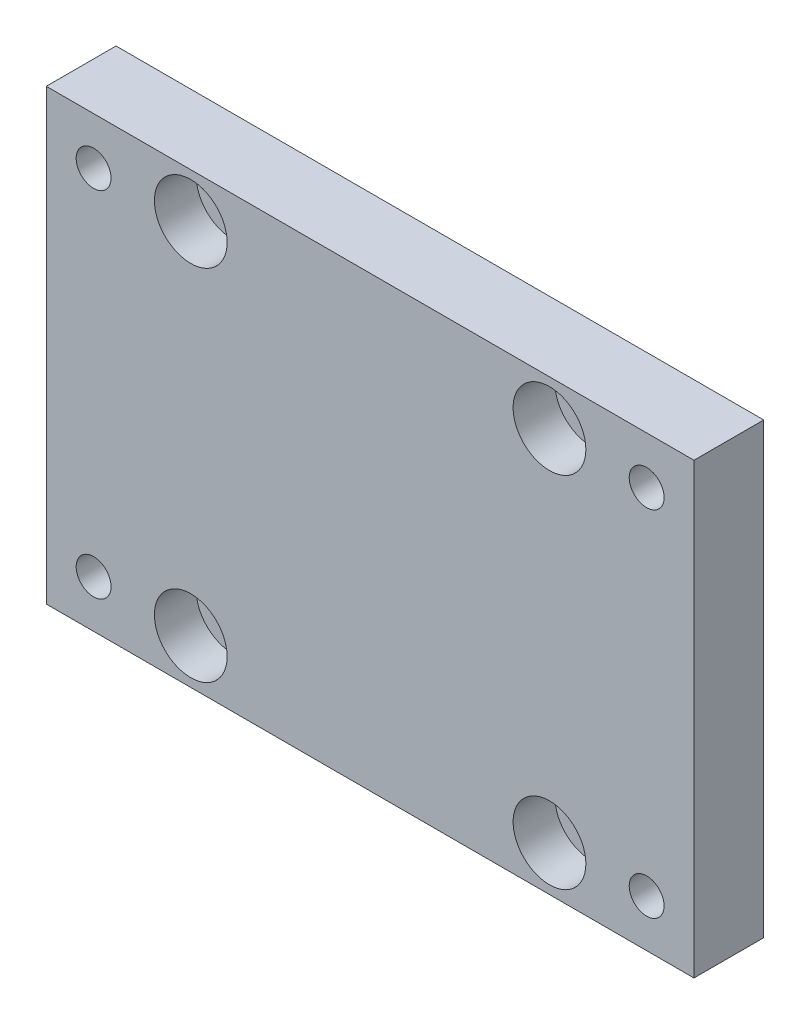
ISO-10303-21;
HEADER;
FILE_DESCRIPTION(('STEP AP214'),'2;1');
FILE_NAME('part.step','',(''),(''),'','','');
FILE_SCHEMA(('AUTOMOTIVE_DESIGN { 1 0 10303 214 1 1 1 1 }'));
ENDSEC;
DATA;
#1=APPLICATION_CONTEXT('core data for automotive mechanical design processes');
#2=APPLICATION_PROTOCOL_DEFINITION('international standard','automotive_design',2000,#1);
#3=PRODUCT_CONTEXT('',#1,'mechanical');
#4=PRODUCT('Part','Part','',(#3));
#5=PRODUCT_RELATED_PRODUCT_CATEGORY('part','',(#4));
#6=PRODUCT_DEFINITION_FORMATION('','',#4);
#7=PRODUCT_DEFINITION_CONTEXT('part definition',#1,'design');
#8=PRODUCT_DEFINITION('design','',#6,#7);
#9=PRODUCT_DEFINITION_SHAPE('','',#8);
#10=(LENGTH_UNIT() NAMED_UNIT(*) SI_UNIT(.MILLI.,.METRE.));
#11=(NAMED_UNIT(*) PLANE_ANGLE_UNIT() SI_UNIT($,.RADIAN.));
#12=(NAMED_UNIT(*) SI_UNIT($,.STERADIAN.) SOLID_ANGLE_UNIT());
#13=UNCERTAINTY_MEASURE_WITH_UNIT(LENGTH_MEASURE(1.E-05),#10,'distance_accuracy_value','');
#14=(GEOMETRIC_REPRESENTATION_CONTEXT(3) GLOBAL_UNCERTAINTY_ASSIGNED_CONTEXT((#13)) GLOBAL_UNIT_ASSIGNED_CONTEXT((#10,
#11,#12)) REPRESENTATION_CONTEXT('',''));
#15=CARTESIAN_POINT('',(0.,0.,0.));
#16=DIRECTION('',(0.,0.,1.));
#17=DIRECTION('',(1.,0.,0.));
#18=AXIS2_PLACEMENT_3D('',#15,#16,#17);
#19=CARTESIAN_POINT('',(-27.75,17.75,7.));
#20=DIRECTION('',(0.,0.,-1.));
#21=DIRECTION('',(-1.,0.,0.));
#22=AXIS2_PLACEMENT_3D('',#19,#20,#21);
#23=CYLINDRICAL_SURFACE('',#22,1.75);
#24=CARTESIAN_POINT('',(-27.75,17.75,7.));
#25=DIRECTION('',(0.,0.,1.));
#26=DIRECTION('',(1.,0.,0.));
#27=AXIS2_PLACEMENT_3D('',#24,#25,#26);
#28=CIRCLE('',#27,1.75);
#29=CARTESIAN_POINT('',(-26.,17.75,7.));
#30=VERTEX_POINT('',#29);
#31=EDGE_CURVE('E185',#30,#30,#28,.T.);
#32=ORIENTED_EDGE('',*,*,#31,.T.);
#33=EDGE_LOOP('',(#32));
#34=FACE_BOUND('',#33,.T.);
#35=CARTESIAN_POINT('',(-27.75,17.75,3.1));
#36=DIRECTION('',(0.,0.,-1.));
#37=DIRECTION('',(-1.,0.,0.));
#38=AXIS2_PLACEMENT_3D('',#35,#36,#37);
#39=CIRCLE('',#38,1.75);
#40=CARTESIAN_POINT('',(-29.5,17.75,3.1));
#41=VERTEX_POINT('',#40);
#42=EDGE_CURVE('E39',#41,#41,#39,.T.);
#43=ORIENTED_EDGE('',*,*,#42,.T.);
#44=EDGE_LOOP('',(#43));
#45=FACE_BOUND('',#44,.T.);
#46=ADVANCED_FACE('F35',(#34,#45),#23,.F.);
#47=CARTESIAN_POINT('',(27.75,17.75,7.));
#48=DIRECTION('',(0.,0.,-1.));
#49=DIRECTION('',(-1.,0.,0.));
#50=AXIS2_PLACEMENT_3D('',#47,#48,#49);
#51=CYLINDRICAL_SURFACE('',#50,1.75);
#52=CARTESIAN_POINT('',(27.75,17.75,7.));
#53=DIRECTION('',(0.,0.,1.));
#54=DIRECTION('',(-1.,0.,0.));
#55=AXIS2_PLACEMENT_3D('',#52,#53,#54);
#56=CIRCLE('',#55,1.75);
#57=CARTESIAN_POINT('',(26.,17.75,7.));
#58=VERTEX_POINT('',#57);
#59=EDGE_CURVE('E173',#58,#58,#56,.T.);
#60=ORIENTED_EDGE('',*,*,#59,.T.);
#61=EDGE_LOOP('',(#60));
#62=FACE_BOUND('',#61,.T.);
#63=CARTESIAN_POINT('',(27.75,17.75,3.1));
#64=DIRECTION('',(0.,0.,-1.));
#65=DIRECTION('',(-1.,0.,0.));
#66=AXIS2_PLACEMENT_3D('',#63,#64,#65);
#67=CIRCLE('',#66,1.75);
#68=CARTESIAN_POINT('',(26.,17.75,3.1));
#69=VERTEX_POINT('',#68);
#70=EDGE_CURVE('E118',#69,#69,#67,.T.);
#71=ORIENTED_EDGE('',*,*,#70,.T.);
#72=EDGE_LOOP('',(#71));
#73=FACE_BOUND('',#72,.T.);
#74=ADVANCED_FACE('F221',(#62,#73),#51,.F.);
#75=CARTESIAN_POINT('',(27.75,-17.75,7.));
#76=DIRECTION('',(0.,0.,-1.));
#77=DIRECTION('',(-1.,0.,0.));
#78=AXIS2_PLACEMENT_3D('',#75,#76,#77);
#79=CYLINDRICAL_SURFACE('',#78,1.75);
#80=CARTESIAN_POINT('',(27.75,-17.75,7.));
#81=DIRECTION('',(0.,0.,1.));
#82=DIRECTION('',(1.,0.,0.));
#83=AXIS2_PLACEMENT_3D('',#80,#81,#82);
#84=CIRCLE('',#83,1.75);
#85=CARTESIAN_POINT('',(29.5,-17.75,7.));
#86=VERTEX_POINT('',#85);
#87=EDGE_CURVE('E170',#86,#86,#84,.T.);
#88=ORIENTED_EDGE('',*,*,#87,.T.);
#89=EDGE_LOOP('',(#88));
#90=FACE_BOUND('',#89,.T.);
#91=CARTESIAN_POINT('',(27.75,-17.75,3.1));
#92=DIRECTION('',(0.,0.,-1.));
#93=DIRECTION('',(-1.,0.,0.));
#94=AXIS2_PLACEMENT_3D('',#91,#92,#93);
#95=CIRCLE('',#94,1.75);
#96=CARTESIAN_POINT('',(26.,-17.75,3.1));
#97=VERTEX_POINT('',#96);
#98=EDGE_CURVE('E115',#97,#97,#95,.T.);
#99=ORIENTED_EDGE('',*,*,#98,.T.);
#100=EDGE_LOOP('',(#99));
#101=FACE_BOUND('',#100,.T.);
#102=ADVANCED_FACE('F227',(#90,#101),#79,.F.);
#103=CARTESIAN_POINT('',(-27.75,-17.75,7.));
#104=DIRECTION('',(0.,0.,-1.));
#105=DIRECTION('',(-1.,0.,0.));
#106=AXIS2_PLACEMENT_3D('',#103,#104,#105);
#107=CYLINDRICAL_SURFACE('',#106,1.75);
#108=CARTESIAN_POINT('',(-27.75,-17.75,7.));
#109=DIRECTION('',(0.,0.,1.));
#110=DIRECTION('',(-1.,0.,0.));
#111=AXIS2_PLACEMENT_3D('',#108,#109,#110);
#112=CIRCLE('',#111,1.75);
#113=CARTESIAN_POINT('',(-29.5,-17.75,7.));
#114=VERTEX_POINT('',#113);
#115=EDGE_CURVE('E167',#114,#114,#112,.T.);
#116=ORIENTED_EDGE('',*,*,#115,.T.);
#117=EDGE_LOOP('',(#116));
#118=FACE_BOUND('',#117,.T.);
#119=CARTESIAN_POINT('',(-27.75,-17.75,3.1));
#120=DIRECTION('',(0.,0.,-1.));
#121=DIRECTION('',(-1.,0.,0.));
#122=AXIS2_PLACEMENT_3D('',#119,#120,#121);
#123=CIRCLE('',#122,1.75);
#124=CARTESIAN_POINT('',(-29.5,-17.75,3.1));
#125=VERTEX_POINT('',#124);
#126=EDGE_CURVE('E112',#125,#125,#123,.T.);
#127=ORIENTED_EDGE('',*,*,#126,.T.);
#128=EDGE_LOOP('',(#127));
#129=FACE_BOUND('',#128,.T.);
#130=ADVANCED_FACE('F198',(#118,#129),#107,.F.);
#131=CARTESIAN_POINT('',(-18.,18.,7.));
#132=DIRECTION('',(0.,0.,-1.));
#133=DIRECTION('',(-1.,0.,0.));
#134=AXIS2_PLACEMENT_3D('',#131,#132,#133);
#135=CYLINDRICAL_SURFACE('',#134,2.25);
#136=CARTESIAN_POINT('',(-18.,18.,0.));
#137=DIRECTION('',(0.,0.,1.));
#138=DIRECTION('',(1.,0.,0.));
#139=AXIS2_PLACEMENT_3D('',#136,#137,#138);
#140=CIRCLE('',#139,2.25);
#141=CARTESIAN_POINT('',(-15.75,18.,0.));
#142=VERTEX_POINT('',#141);
#143=EDGE_CURVE('E106',#142,#142,#140,.T.);
#144=ORIENTED_EDGE('',*,*,#143,.F.);
#145=EDGE_LOOP('',(#144));
#146=FACE_BOUND('',#145,.T.);
#147=CARTESIAN_POINT('',(-18.,18.,2.8));
#148=DIRECTION('',(0.,0.,1.));
#149=DIRECTION('',(1.,0.,0.));
#150=AXIS2_PLACEMENT_3D('',#147,#148,#149);
#151=CIRCLE('',#150,2.25000000000001);
#152=CARTESIAN_POINT('',(-15.75,18.,2.8));
#153=VERTEX_POINT('',#152);
#154=EDGE_CURVE('E132',#153,#153,#151,.T.);
#155=ORIENTED_EDGE('',*,*,#154,.T.);
#156=EDGE_LOOP('',(#155));
#157=FACE_BOUND('',#156,.T.);
#158=ADVANCED_FACE('F194',(#146,#157),#135,.F.);
#159=CARTESIAN_POINT('',(18.,18.,7.));
#160=DIRECTION('',(0.,0.,-1.));
#161=DIRECTION('',(-1.,0.,0.));
#162=AXIS2_PLACEMENT_3D('',#159,#160,#161);
#163=CYLINDRICAL_SURFACE('',#162,2.25);
#164=CARTESIAN_POINT('',(18.,18.,0.));
#165=DIRECTION('',(0.,0.,1.));
#166=DIRECTION('',(-1.,0.,0.));
#167=AXIS2_PLACEMENT_3D('',#164,#165,#166);
#168=CIRCLE('',#167,2.25);
#169=CARTESIAN_POINT('',(15.75,18.,0.));
#170=VERTEX_POINT('',#169);
#171=EDGE_CURVE('E182',#170,#170,#168,.T.);
#172=ORIENTED_EDGE('',*,*,#171,.F.);
#173=EDGE_LOOP('',(#172));
#174=FACE_BOUND('',#173,.T.);
#175=CARTESIAN_POINT('',(18.,18.,2.8));
#176=DIRECTION('',(0.,0.,1.));
#177=DIRECTION('',(1.,0.,0.));
#178=AXIS2_PLACEMENT_3D('',#175,#176,#177);
#179=CIRCLE('',#178,2.25000000000001);
#180=CARTESIAN_POINT('',(20.25,18.,2.8));
#181=VERTEX_POINT('',#180);
#182=EDGE_CURVE('E146',#181,#181,#179,.T.);
#183=ORIENTED_EDGE('',*,*,#182,.T.);
#184=EDGE_LOOP('',(#183));
#185=FACE_BOUND('',#184,.T.);
#186=ADVANCED_FACE('F197',(#174,#185),#163,.F.);
#187=CARTESIAN_POINT('',(18.,-18.,7.));
#188=DIRECTION('',(0.,0.,-1.));
#189=DIRECTION('',(-1.,0.,0.));
#190=AXIS2_PLACEMENT_3D('',#187,#188,#189);
#191=CYLINDRICAL_SURFACE('',#190,2.25);
#192=CARTESIAN_POINT('',(18.,-18.,0.));
#193=DIRECTION('',(0.,0.,1.));
#194=DIRECTION('',(1.,0.,0.));
#195=AXIS2_PLACEMENT_3D('',#192,#193,#194);
#196=CIRCLE('',#195,2.25);
#197=CARTESIAN_POINT('',(20.25,-18.,0.));
#198=VERTEX_POINT('',#197);
#199=EDGE_CURVE('E179',#198,#198,#196,.T.);
#200=ORIENTED_EDGE('',*,*,#199,.F.);
#201=EDGE_LOOP('',(#200));
#202=FACE_BOUND('',#201,.T.);
#203=CARTESIAN_POINT('',(18.,-18.,2.8));
#204=DIRECTION('',(0.,0.,1.));
#205=DIRECTION('',(1.,0.,0.));
#206=AXIS2_PLACEMENT_3D('',#203,#204,#205);
#207=CIRCLE('',#206,2.25000000000001);
#208=CARTESIAN_POINT('',(20.25,-18.,2.8));
#209=VERTEX_POINT('',#208);
#210=EDGE_CURVE('E155',#209,#209,#207,.T.);
#211=ORIENTED_EDGE('',*,*,#210,.T.);
#212=EDGE_LOOP('',(#211));
#213=FACE_BOUND('',#212,.T.);
#214=ADVANCED_FACE('F271',(#202,#213),#191,.F.);
#215=CARTESIAN_POINT('',(-18.,-18.,7.));
#216=DIRECTION('',(0.,0.,-1.));
#217=DIRECTION('',(-1.,0.,0.));
#218=AXIS2_PLACEMENT_3D('',#215,#216,#217);
#219=CYLINDRICAL_SURFACE('',#218,2.25);
#220=CARTESIAN_POINT('',(-18.,-18.,0.));
#221=DIRECTION('',(0.,0.,1.));
#222=DIRECTION('',(-1.,0.,0.));
#223=AXIS2_PLACEMENT_3D('',#220,#221,#222);
#224=CIRCLE('',#223,2.25);
#225=CARTESIAN_POINT('',(-20.25,-18.,0.));
#226=VERTEX_POINT('',#225);
#227=EDGE_CURVE('E176',#226,#226,#224,.T.);
#228=ORIENTED_EDGE('',*,*,#227,.F.);
#229=EDGE_LOOP('',(#228));
#230=FACE_BOUND('',#229,.T.);
#231=CARTESIAN_POINT('',(-18.,-18.,2.8));
#232=DIRECTION('',(0.,0.,1.));
#233=DIRECTION('',(1.,0.,0.));
#234=AXIS2_PLACEMENT_3D('',#231,#232,#233);
#235=CIRCLE('',#234,2.25000000000001);
#236=CARTESIAN_POINT('',(-15.75,-18.,2.8));
#237=VERTEX_POINT('',#236);
#238=EDGE_CURVE('E164',#237,#237,#235,.T.);
#239=ORIENTED_EDGE('',*,*,#238,.T.);
#240=EDGE_LOOP('',(#239));
#241=FACE_BOUND('',#240,.T.);
#242=ADVANCED_FACE('F235',(#230,#241),#219,.F.);
#243=CARTESIAN_POINT('',(0.,0.,7.));
#244=DIRECTION('',(0.,0.,1.));
#245=DIRECTION('',(1.,0.,0.));
#246=AXIS2_PLACEMENT_3D('',#243,#244,#245);
#247=PLANE('',#246);
#248=CARTESIAN_POINT('',(-18.,18.,7.));
#249=DIRECTION('',(0.,0.,1.));
#250=DIRECTION('',(1.,0.,0.));
#251=AXIS2_PLACEMENT_3D('',#248,#249,#250);
#252=CIRCLE('',#251,3.65000000000001);
#253=CARTESIAN_POINT('',(-14.35,18.,7.));
#254=VERTEX_POINT('',#253);
#255=EDGE_CURVE('E123',#254,#254,#252,.T.);
#256=ORIENTED_EDGE('',*,*,#255,.F.);
#257=EDGE_LOOP('',(#256));
#258=FACE_BOUND('',#257,.T.);
#259=CARTESIAN_POINT('',(18.,18.,7.));
#260=DIRECTION('',(0.,0.,1.));
#261=DIRECTION('',(1.,0.,0.));
#262=AXIS2_PLACEMENT_3D('',#259,#260,#261);
#263=CIRCLE('',#262,3.65000000000001);
#264=CARTESIAN_POINT('',(21.65,18.,7.));
#265=VERTEX_POINT('',#264);
#266=EDGE_CURVE('E140',#265,#265,#263,.T.);
#267=ORIENTED_EDGE('',*,*,#266,.F.);
#268=EDGE_LOOP('',(#267));
#269=FACE_BOUND('',#268,.T.);
#270=CARTESIAN_POINT('',(18.,-18.,7.));
#271=DIRECTION('',(0.,0.,1.));
#272=DIRECTION('',(1.,0.,0.));
#273=AXIS2_PLACEMENT_3D('',#270,#271,#272);
#274=CIRCLE('',#273,3.65000000000001);
#275=CARTESIAN_POINT('',(21.65,-18.,7.));
#276=VERTEX_POINT('',#275);
#277=EDGE_CURVE('E149',#276,#276,#274,.T.);
#278=ORIENTED_EDGE('',*,*,#277,.F.);
#279=EDGE_LOOP('',(#278));
#280=FACE_BOUND('',#279,.T.);
#281=CARTESIAN_POINT('',(-18.,-18.,7.));
#282=DIRECTION('',(0.,0.,1.));
#283=DIRECTION('',(1.,0.,0.));
#284=AXIS2_PLACEMENT_3D('',#281,#282,#283);
#285=CIRCLE('',#284,3.65000000000001);
#286=CARTESIAN_POINT('',(-14.35,-18.,7.));
#287=VERTEX_POINT('',#286);
#288=EDGE_CURVE('E158',#287,#287,#285,.T.);
#289=ORIENTED_EDGE('',*,*,#288,.F.);
#290=EDGE_LOOP('',(#289));
#291=FACE_BOUND('',#290,.T.);
#292=ORIENTED_EDGE('',*,*,#87,.F.);
#293=EDGE_LOOP('',(#292));
#294=FACE_BOUND('',#293,.T.);
#295=DIRECTION('',(0.,1.,0.));
#296=VECTOR('',#295,1.);
#297=CARTESIAN_POINT('',(32.5,22.5,7.));
#298=LINE('',#297,#296);
#299=CARTESIAN_POINT('',(32.5,-22.5,7.));
#300=VERTEX_POINT('',#299);
#301=CARTESIAN_POINT('',(32.5,22.5,7.));
#302=VERTEX_POINT('',#301);
#303=EDGE_CURVE('E90',#300,#302,#298,.T.);
#304=ORIENTED_EDGE('',*,*,#303,.T.);
#305=DIRECTION('',(-1.,0.,0.));
#306=VECTOR('',#305,1.);
#307=CARTESIAN_POINT('',(-32.5,22.5,7.));
#308=LINE('',#307,#306);
#309=CARTESIAN_POINT('',(-32.5,22.5,7.));
#310=VERTEX_POINT('',#309);
#311=EDGE_CURVE('E84',#302,#310,#308,.T.);
#312=ORIENTED_EDGE('',*,*,#311,.T.);
#313=DIRECTION('',(0.,-1.,0.));
#314=VECTOR('',#313,1.);
#315=CARTESIAN_POINT('',(-32.5,22.5,7.));
#316=LINE('',#315,#314);
#317=CARTESIAN_POINT('',(-32.5,-22.5,7.));
#318=VERTEX_POINT('',#317);
#319=EDGE_CURVE('E88',#310,#318,#316,.T.);
#320=ORIENTED_EDGE('',*,*,#319,.T.);
#321=DIRECTION('',(1.,0.,0.));
#322=VECTOR('',#321,1.);
#323=CARTESIAN_POINT('',(-32.5,-22.5,7.));
#324=LINE('',#323,#322);
#325=EDGE_CURVE('E54',#318,#300,#324,.T.);
#326=ORIENTED_EDGE('',*,*,#325,.T.);
#327=EDGE_LOOP('',(#304,#312,#320,#326));
#328=FACE_BOUND('',#327,.T.);
#329=ORIENTED_EDGE('',*,*,#31,.F.);
#330=EDGE_LOOP('',(#329));
#331=FACE_BOUND('',#330,.T.);
#332=ORIENTED_EDGE('',*,*,#59,.F.);
#333=EDGE_LOOP('',(#332));
#334=FACE_BOUND('',#333,.T.);
#335=ORIENTED_EDGE('',*,*,#115,.F.);
#336=EDGE_LOOP('',(#335));
#337=FACE_BOUND('',#336,.T.);
#338=ADVANCED_FACE('F85',(#258,#269,#280,#291,#294,#328,#331,#334,#337),#247,.T.);
#339=CARTESIAN_POINT('',(0.,0.,0.));
#340=DIRECTION('',(0.,0.,1.));
#341=DIRECTION('',(1.,0.,0.));
#342=AXIS2_PLACEMENT_3D('',#339,#340,#341);
#343=PLANE('',#342);
#344=CARTESIAN_POINT('',(27.75,-17.75,0.));
#345=DIRECTION('',(0.,0.,-1.));
#346=DIRECTION('',(-1.,0.,0.));
#347=AXIS2_PLACEMENT_3D('',#344,#345,#346);
#348=CIRCLE('',#347,2.9);
#349=CARTESIAN_POINT('',(24.85,-17.75,0.));
#350=VERTEX_POINT('',#349);
#351=EDGE_CURVE('E434',#350,#350,#348,.T.);
#352=ORIENTED_EDGE('',*,*,#351,.F.);
#353=EDGE_LOOP('',(#352));
#354=FACE_BOUND('',#353,.T.);
#355=CARTESIAN_POINT('',(-27.75,-17.75,0.));
#356=DIRECTION('',(0.,0.,-1.));
#357=DIRECTION('',(-1.,0.,0.));
#358=AXIS2_PLACEMENT_3D('',#355,#356,#357);
#359=CIRCLE('',#358,2.9);
#360=CARTESIAN_POINT('',(-30.65,-17.75,0.));
#361=VERTEX_POINT('',#360);
#362=EDGE_CURVE('E433',#361,#361,#359,.T.);
#363=ORIENTED_EDGE('',*,*,#362,.F.);
#364=EDGE_LOOP('',(#363));
#365=FACE_BOUND('',#364,.T.);
#366=CARTESIAN_POINT('',(-27.75,17.75,0.));
#367=DIRECTION('',(0.,0.,-1.));
#368=DIRECTION('',(-1.,0.,0.));
#369=AXIS2_PLACEMENT_3D('',#366,#367,#368);
#370=CIRCLE('',#369,2.9);
#371=CARTESIAN_POINT('',(-30.65,17.75,0.));
#372=VERTEX_POINT('',#371);
#373=EDGE_CURVE('E450',#372,#372,#370,.T.);
#374=ORIENTED_EDGE('',*,*,#373,.F.);
#375=EDGE_LOOP('',(#374));
#376=FACE_BOUND('',#375,.T.);
#377=CARTESIAN_POINT('',(27.75,17.75,0.));
#378=DIRECTION('',(0.,0.,-1.));
#379=DIRECTION('',(-1.,0.,0.));
#380=AXIS2_PLACEMENT_3D('',#377,#378,#379);
#381=CIRCLE('',#380,2.9);
#382=CARTESIAN_POINT('',(24.85,17.75,0.));
#383=VERTEX_POINT('',#382);
#384=EDGE_CURVE('E135',#383,#383,#381,.T.);
#385=ORIENTED_EDGE('',*,*,#384,.F.);
#386=EDGE_LOOP('',(#385));
#387=FACE_BOUND('',#386,.T.);
#388=DIRECTION('',(0.,1.,0.));
#389=VECTOR('',#388,1.);
#390=CARTESIAN_POINT('',(32.5,22.5,0.));
#391=LINE('',#390,#389);
#392=CARTESIAN_POINT('',(32.5,-22.5,0.));
#393=VERTEX_POINT('',#392);
#394=CARTESIAN_POINT('',(32.5,22.5,0.));
#395=VERTEX_POINT('',#394);
#396=EDGE_CURVE('E103',#393,#395,#391,.T.);
#397=ORIENTED_EDGE('',*,*,#396,.F.);
#398=DIRECTION('',(1.,0.,0.));
#399=VECTOR('',#398,1.);
#400=CARTESIAN_POINT('',(-32.5,-22.5,0.));
#401=LINE('',#400,#399);
#402=CARTESIAN_POINT('',(-32.5,-22.5,0.));
#403=VERTEX_POINT('',#402);
#404=EDGE_CURVE('E77',#403,#393,#401,.T.);
#405=ORIENTED_EDGE('',*,*,#404,.F.);
#406=DIRECTION('',(0.,-1.,0.));
#407=VECTOR('',#406,1.);
#408=CARTESIAN_POINT('',(-32.5,22.5,0.));
#409=LINE('',#408,#407);
#410=CARTESIAN_POINT('',(-32.5,22.5,0.));
#411=VERTEX_POINT('',#410);
#412=EDGE_CURVE('E71',#411,#403,#409,.T.);
#413=ORIENTED_EDGE('',*,*,#412,.F.);
#414=DIRECTION('',(-1.,0.,0.));
#415=VECTOR('',#414,1.);
#416=CARTESIAN_POINT('',(-32.5,22.5,0.));
#417=LINE('',#416,#415);
#418=EDGE_CURVE('E94',#395,#411,#417,.T.);
#419=ORIENTED_EDGE('',*,*,#418,.F.);
#420=EDGE_LOOP('',(#397,#405,#413,#419));
#421=FACE_BOUND('',#420,.T.);
#422=ORIENTED_EDGE('',*,*,#143,.T.);
#423=EDGE_LOOP('',(#422));
#424=FACE_BOUND('',#423,.T.);
#425=ORIENTED_EDGE('',*,*,#171,.T.);
#426=EDGE_LOOP('',(#425));
#427=FACE_BOUND('',#426,.T.);
#428=ORIENTED_EDGE('',*,*,#199,.T.);
#429=EDGE_LOOP('',(#428));
#430=FACE_BOUND('',#429,.T.);
#431=ORIENTED_EDGE('',*,*,#227,.T.);
#432=EDGE_LOOP('',(#431));
#433=FACE_BOUND('',#432,.T.);
#434=ADVANCED_FACE('F191',(#354,#365,#376,#387,#421,#424,#427,#430,#433),#343,.F.);
#435=CARTESIAN_POINT('',(32.5,22.5,7.));
#436=DIRECTION('',(-1.,0.,0.));
#437=DIRECTION('',(0.,0.,1.));
#438=AXIS2_PLACEMENT_3D('',#435,#436,#437);
#439=PLANE('',#438);
#440=ORIENTED_EDGE('',*,*,#396,.T.);
#441=DIRECTION('',(0.,0.,-1.));
#442=VECTOR('',#441,1.);
#443=CARTESIAN_POINT('',(32.5,22.5,7.));
#444=LINE('',#443,#442);
#445=EDGE_CURVE('E11',#302,#395,#444,.T.);
#446=ORIENTED_EDGE('',*,*,#445,.F.);
#447=ORIENTED_EDGE('',*,*,#303,.F.);
#448=DIRECTION('',(0.,0.,-1.));
#449=VECTOR('',#448,1.);
#450=CARTESIAN_POINT('',(32.5,-22.5,7.));
#451=LINE('',#450,#449);
#452=EDGE_CURVE('E99',#300,#393,#451,.T.);
#453=ORIENTED_EDGE('',*,*,#452,.T.);
#454=EDGE_LOOP('',(#440,#446,#447,#453));
#455=FACE_BOUND('',#454,.T.);
#456=ADVANCED_FACE('F37',(#455),#439,.F.);
#457=CARTESIAN_POINT('',(-32.5,22.5,7.));
#458=DIRECTION('',(0.,-1.,0.));
#459=DIRECTION('',(0.,0.,-1.));
#460=AXIS2_PLACEMENT_3D('',#457,#458,#459);
#461=PLANE('',#460);
#462=ORIENTED_EDGE('',*,*,#418,.T.);
#463=DIRECTION('',(0.,0.,-1.));
#464=VECTOR('',#463,1.);
#465=CARTESIAN_POINT('',(-32.5,22.5,7.));
#466=LINE('',#465,#464);
#467=EDGE_CURVE('E45',#310,#411,#466,.T.);
#468=ORIENTED_EDGE('',*,*,#467,.F.);
#469=ORIENTED_EDGE('',*,*,#311,.F.);
#470=ORIENTED_EDGE('',*,*,#445,.T.);
#471=EDGE_LOOP('',(#462,#468,#469,#470));
#472=FACE_BOUND('',#471,.T.);
#473=ADVANCED_FACE('F93',(#472),#461,.F.);
#474=CARTESIAN_POINT('',(-32.5,22.5,7.));
#475=DIRECTION('',(1.,0.,0.));
#476=DIRECTION('',(0.,0.,-1.));
#477=AXIS2_PLACEMENT_3D('',#474,#475,#476);
#478=PLANE('',#477);
#479=ORIENTED_EDGE('',*,*,#412,.T.);
#480=DIRECTION('',(0.,0.,-1.));
#481=VECTOR('',#480,1.);
#482=CARTESIAN_POINT('',(-32.5,-22.5,7.));
#483=LINE('',#482,#481);
#484=EDGE_CURVE('E95',#318,#403,#483,.T.);
#485=ORIENTED_EDGE('',*,*,#484,.F.);
#486=ORIENTED_EDGE('',*,*,#319,.F.);
#487=ORIENTED_EDGE('',*,*,#467,.T.);
#488=EDGE_LOOP('',(#479,#485,#486,#487));
#489=FACE_BOUND('',#488,.T.);
#490=ADVANCED_FACE('F97',(#489),#478,.F.);
#491=CARTESIAN_POINT('',(-32.5,-22.5,7.));
#492=DIRECTION('',(0.,1.,0.));
#493=DIRECTION('',(0.,0.,1.));
#494=AXIS2_PLACEMENT_3D('',#491,#492,#493);
#495=PLANE('',#494);
#496=ORIENTED_EDGE('',*,*,#404,.T.);
#497=ORIENTED_EDGE('',*,*,#452,.F.);
#498=ORIENTED_EDGE('',*,*,#325,.F.);
#499=ORIENTED_EDGE('',*,*,#484,.T.);
#500=EDGE_LOOP('',(#496,#497,#498,#499));
#501=FACE_BOUND('',#500,.T.);
#502=ADVANCED_FACE('F240',(#501),#495,.F.);
#503=CARTESIAN_POINT('',(-15.75,-18.,2.8));
#504=DIRECTION('',(0.,0.,-1.));
#505=DIRECTION('',(-1.,0.,0.));
#506=AXIS2_PLACEMENT_3D('',#503,#504,#505);
#507=PLANE('',#506);
#508=ORIENTED_EDGE('',*,*,#238,.F.);
#509=EDGE_LOOP('',(#508));
#510=FACE_BOUND('',#509,.T.);
#511=CARTESIAN_POINT('',(-18.,-18.,2.8));
#512=DIRECTION('',(0.,0.,1.));
#513=DIRECTION('',(1.,0.,0.));
#514=AXIS2_PLACEMENT_3D('',#511,#512,#513);
#515=CIRCLE('',#514,3.65000000000001);
#516=CARTESIAN_POINT('',(-14.35,-18.,2.8));
#517=VERTEX_POINT('',#516);
#518=EDGE_CURVE('E161',#517,#517,#515,.T.);
#519=ORIENTED_EDGE('',*,*,#518,.T.);
#520=EDGE_LOOP('',(#519));
#521=FACE_BOUND('',#520,.T.);
#522=ADVANCED_FACE('F243',(#510,#521),#507,.F.);
#523=CARTESIAN_POINT('',(-18.,-18.,7.));
#524=DIRECTION('',(0.,0.,1.));
#525=DIRECTION('',(1.,0.,0.));
#526=AXIS2_PLACEMENT_3D('',#523,#524,#525);
#527=CYLINDRICAL_SURFACE('',#526,3.65000000000001);
#528=ORIENTED_EDGE('',*,*,#518,.F.);
#529=EDGE_LOOP('',(#528));
#530=FACE_BOUND('',#529,.T.);
#531=ORIENTED_EDGE('',*,*,#288,.T.);
#532=EDGE_LOOP('',(#531));
#533=FACE_BOUND('',#532,.T.);
#534=ADVANCED_FACE('F361',(#530,#533),#527,.F.);
#535=CARTESIAN_POINT('',(20.25,-18.,2.8));
#536=DIRECTION('',(0.,0.,-1.));
#537=DIRECTION('',(-1.,0.,0.));
#538=AXIS2_PLACEMENT_3D('',#535,#536,#537);
#539=PLANE('',#538);
#540=ORIENTED_EDGE('',*,*,#210,.F.);
#541=EDGE_LOOP('',(#540));
#542=FACE_BOUND('',#541,.T.);
#543=CARTESIAN_POINT('',(18.,-18.,2.8));
#544=DIRECTION('',(0.,0.,1.));
#545=DIRECTION('',(1.,0.,0.));
#546=AXIS2_PLACEMENT_3D('',#543,#544,#545);
#547=CIRCLE('',#546,3.65000000000001);
#548=CARTESIAN_POINT('',(21.65,-18.,2.8));
#549=VERTEX_POINT('',#548);
#550=EDGE_CURVE('E152',#549,#549,#547,.T.);
#551=ORIENTED_EDGE('',*,*,#550,.T.);
#552=EDGE_LOOP('',(#551));
#553=FACE_BOUND('',#552,.T.);
#554=ADVANCED_FACE('F351',(#542,#553),#539,.F.);
#555=CARTESIAN_POINT('',(18.,-18.,7.));
#556=DIRECTION('',(0.,0.,1.));
#557=DIRECTION('',(1.,0.,0.));
#558=AXIS2_PLACEMENT_3D('',#555,#556,#557);
#559=CYLINDRICAL_SURFACE('',#558,3.65000000000001);
#560=ORIENTED_EDGE('',*,*,#550,.F.);
#561=EDGE_LOOP('',(#560));
#562=FACE_BOUND('',#561,.T.);
#563=ORIENTED_EDGE('',*,*,#277,.T.);
#564=EDGE_LOOP('',(#563));
#565=FACE_BOUND('',#564,.T.);
#566=ADVANCED_FACE('F341',(#562,#565),#559,.F.);
#567=CARTESIAN_POINT('',(20.25,18.,2.8));
#568=DIRECTION('',(0.,0.,-1.));
#569=DIRECTION('',(-1.,0.,0.));
#570=AXIS2_PLACEMENT_3D('',#567,#568,#569);
#571=PLANE('',#570);
#572=ORIENTED_EDGE('',*,*,#182,.F.);
#573=EDGE_LOOP('',(#572));
#574=FACE_BOUND('',#573,.T.);
#575=CARTESIAN_POINT('',(18.,18.,2.8));
#576=DIRECTION('',(0.,0.,1.));
#577=DIRECTION('',(1.,0.,0.));
#578=AXIS2_PLACEMENT_3D('',#575,#576,#577);
#579=CIRCLE('',#578,3.65000000000001);
#580=CARTESIAN_POINT('',(21.65,18.,2.8));
#581=VERTEX_POINT('',#580);
#582=EDGE_CURVE('E143',#581,#581,#579,.T.);
#583=ORIENTED_EDGE('',*,*,#582,.T.);
#584=EDGE_LOOP('',(#583));
#585=FACE_BOUND('',#584,.T.);
#586=ADVANCED_FACE('F331',(#574,#585),#571,.F.);
#587=CARTESIAN_POINT('',(18.,18.,7.));
#588=DIRECTION('',(0.,0.,1.));
#589=DIRECTION('',(1.,0.,0.));
#590=AXIS2_PLACEMENT_3D('',#587,#588,#589);
#591=CYLINDRICAL_SURFACE('',#590,3.65000000000001);
#592=ORIENTED_EDGE('',*,*,#582,.F.);
#593=EDGE_LOOP('',(#592));
#594=FACE_BOUND('',#593,.T.);
#595=ORIENTED_EDGE('',*,*,#266,.T.);
#596=EDGE_LOOP('',(#595));
#597=FACE_BOUND('',#596,.T.);
#598=ADVANCED_FACE('F206',(#594,#597),#591,.F.);
#599=CARTESIAN_POINT('',(-15.75,18.,2.8));
#600=DIRECTION('',(0.,0.,-1.));
#601=DIRECTION('',(-1.,0.,0.));
#602=AXIS2_PLACEMENT_3D('',#599,#600,#601);
#603=PLANE('',#602);
#604=ORIENTED_EDGE('',*,*,#154,.F.);
#605=EDGE_LOOP('',(#604));
#606=FACE_BOUND('',#605,.T.);
#607=CARTESIAN_POINT('',(-18.,18.,2.8));
#608=DIRECTION('',(0.,0.,1.));
#609=DIRECTION('',(1.,0.,0.));
#610=AXIS2_PLACEMENT_3D('',#607,#608,#609);
#611=CIRCLE('',#610,3.65000000000001);
#612=CARTESIAN_POINT('',(-14.35,18.,2.8));
#613=VERTEX_POINT('',#612);
#614=EDGE_CURVE('E127',#613,#613,#611,.T.);
#615=ORIENTED_EDGE('',*,*,#614,.T.);
#616=EDGE_LOOP('',(#615));
#617=FACE_BOUND('',#616,.T.);
#618=ADVANCED_FACE('F202',(#606,#617),#603,.F.);
#619=CARTESIAN_POINT('',(-18.,18.,7.));
#620=DIRECTION('',(0.,0.,1.));
#621=DIRECTION('',(1.,0.,0.));
#622=AXIS2_PLACEMENT_3D('',#619,#620,#621);
#623=CYLINDRICAL_SURFACE('',#622,3.65000000000001);
#624=ORIENTED_EDGE('',*,*,#614,.F.);
#625=EDGE_LOOP('',(#624));
#626=FACE_BOUND('',#625,.T.);
#627=ORIENTED_EDGE('',*,*,#255,.T.);
#628=EDGE_LOOP('',(#627));
#629=FACE_BOUND('',#628,.T.);
#630=ADVANCED_FACE('F205',(#626,#629),#623,.F.);
#631=CARTESIAN_POINT('',(-27.75,-17.75,3.1));
#632=DIRECTION('',(0.,0.,-1.));
#633=DIRECTION('',(-1.,0.,0.));
#634=AXIS2_PLACEMENT_3D('',#631,#632,#633);
#635=CYLINDRICAL_SURFACE('',#634,2.9);
#636=CARTESIAN_POINT('',(-27.75,-17.75,3.1));
#637=DIRECTION('',(0.,0.,-1.));
#638=DIRECTION('',(-1.,0.,0.));
#639=AXIS2_PLACEMENT_3D('',#636,#637,#638);
#640=CIRCLE('',#639,2.9);
#641=CARTESIAN_POINT('',(-30.65,-17.75,3.1));
#642=VERTEX_POINT('',#641);
#643=EDGE_CURVE('E437',#642,#642,#640,.T.);
#644=CARTESIAN_POINT('',(-30.65,-17.75,3.1));
#645=CARTESIAN_POINT('',(-30.65,-17.75,3.06770833333333));
#646=CARTESIAN_POINT('',(-30.65,-17.75,3.03541666666667));
#647=CARTESIAN_POINT('',(-30.65,-17.75,2.97083333333333));
#648=CARTESIAN_POINT('',(-30.65,-17.75,2.93854166666667));
#649=CARTESIAN_POINT('',(-30.65,-17.75,2.87395833333333));
#650=CARTESIAN_POINT('',(-30.65,-17.75,2.84166666666667));
#651=CARTESIAN_POINT('',(-30.65,-17.75,2.77708333333333));
#652=CARTESIAN_POINT('',(-30.65,-17.75,2.74479166666667));
#653=CARTESIAN_POINT('',(-30.65,-17.75,2.68020833333333));
#654=CARTESIAN_POINT('',(-30.65,-17.75,2.64791666666667));
#655=CARTESIAN_POINT('',(-30.65,-17.75,2.58333333333333));
#656=CARTESIAN_POINT('',(-30.65,-17.75,2.55104166666667));
#657=CARTESIAN_POINT('',(-30.65,-17.75,2.48645833333333));
#658=CARTESIAN_POINT('',(-30.65,-17.75,2.45416666666667));
#659=CARTESIAN_POINT('',(-30.65,-17.75,2.38958333333333));
#660=CARTESIAN_POINT('',(-30.65,-17.75,2.35729166666667));
#661=CARTESIAN_POINT('',(-30.65,-17.75,2.29270833333333));
#662=CARTESIAN_POINT('',(-30.65,-17.75,2.26041666666667));
#663=CARTESIAN_POINT('',(-30.65,-17.75,2.19583333333333));
#664=CARTESIAN_POINT('',(-30.65,-17.75,2.16354166666667));
#665=CARTESIAN_POINT('',(-30.65,-17.75,2.09895833333333));
#666=CARTESIAN_POINT('',(-30.65,-17.75,2.06666666666667));
#667=CARTESIAN_POINT('',(-30.65,-17.75,2.00208333333333));
#668=CARTESIAN_POINT('',(-30.65,-17.75,1.96979166666667));
#669=CARTESIAN_POINT('',(-30.65,-17.75,1.90520833333333));
#670=CARTESIAN_POINT('',(-30.65,-17.75,1.87291666666667));
#671=CARTESIAN_POINT('',(-30.65,-17.75,1.80833333333333));
#672=CARTESIAN_POINT('',(-30.65,-17.75,1.77604166666667));
#673=CARTESIAN_POINT('',(-30.65,-17.75,1.71145833333333));
#674=CARTESIAN_POINT('',(-30.65,-17.75,1.67916666666667));
#675=CARTESIAN_POINT('',(-30.65,-17.75,1.61458333333333));
#676=CARTESIAN_POINT('',(-30.65,-17.75,1.58229166666667));
#677=CARTESIAN_POINT('',(-30.65,-17.75,1.51770833333333));
#678=CARTESIAN_POINT('',(-30.65,-17.75,1.48541666666667));
#679=CARTESIAN_POINT('',(-30.65,-17.75,1.42083333333333));
#680=CARTESIAN_POINT('',(-30.65,-17.75,1.38854166666667));
#681=CARTESIAN_POINT('',(-30.65,-17.75,1.32395833333333));
#682=CARTESIAN_POINT('',(-30.65,-17.75,1.29166666666667));
#683=CARTESIAN_POINT('',(-30.65,-17.75,1.22708333333333));
#684=CARTESIAN_POINT('',(-30.65,-17.75,1.19479166666667));
#685=CARTESIAN_POINT('',(-30.65,-17.75,1.13020833333333));
#686=CARTESIAN_POINT('',(-30.65,-17.75,1.09791666666667));
#687=CARTESIAN_POINT('',(-30.65,-17.75,1.03333333333333));
#688=CARTESIAN_POINT('',(-30.65,-17.75,1.00104166666667));
#689=CARTESIAN_POINT('',(-30.65,-17.75,0.936458333333334));
#690=CARTESIAN_POINT('',(-30.65,-17.75,0.904166666666667));
#691=CARTESIAN_POINT('',(-30.65,-17.75,0.839583333333334));
#692=CARTESIAN_POINT('',(-30.65,-17.75,0.807291666666667));
#693=CARTESIAN_POINT('',(-30.65,-17.75,0.742708333333334));
#694=CARTESIAN_POINT('',(-30.65,-17.75,0.710416666666667));
#695=CARTESIAN_POINT('',(-30.65,-17.75,0.645833333333334));
#696=CARTESIAN_POINT('',(-30.65,-17.75,0.613541666666667));
#697=CARTESIAN_POINT('',(-30.65,-17.75,0.548958333333333));
#698=CARTESIAN_POINT('',(-30.65,-17.75,0.516666666666667));
#699=CARTESIAN_POINT('',(-30.65,-17.75,0.452083333333333));
#700=CARTESIAN_POINT('',(-30.65,-17.75,0.419791666666667));
#701=CARTESIAN_POINT('',(-30.65,-17.75,0.355208333333334));
#702=CARTESIAN_POINT('',(-30.65,-17.75,0.322916666666667));
#703=CARTESIAN_POINT('',(-30.65,-17.75,0.258333333333333));
#704=CARTESIAN_POINT('',(-30.65,-17.75,0.226041666666667));
#705=CARTESIAN_POINT('',(-30.65,-17.75,0.161458333333333));
#706=CARTESIAN_POINT('',(-30.65,-17.75,0.129166666666667));
#707=CARTESIAN_POINT('',(-30.65,-17.75,0.0645833333333335));
#708=CARTESIAN_POINT('',(-30.65,-17.75,0.0322916666666667));
#709=CARTESIAN_POINT('',(-30.65,-17.75,0.));
#710=B_SPLINE_CURVE_WITH_KNOTS('',3,(#644,#645,#646,#647,#648,#649,#650,#651,#652,#653,#654,
#655,#656,#657,#658,#659,#660,#661,#662,#663,#664,#665,#666,#667,#668,#669,#670,#671,#672,#673,
#674,#675,#676,#677,#678,#679,#680,#681,#682,#683,#684,#685,#686,#687,#688,#689,#690,#691,#692,
#693,#694,#695,#696,#697,#698,#699,#700,#701,#702,#703,#704,#705,#706,#707,#708,#709),
.UNSPECIFIED.,.F.,.F.,(4,2,2,2,2,2,2,2,2,2,2,2,2,2,2,2,2,2,2,2,2,2,2,2,2,2,2,2,2,2,2,2,4),(0.,
0.0968750000000002,0.19375,0.290625,0.3875,0.484375,0.58125,0.678125,0.775,0.871875,0.96875,
1.065625,1.1625,1.259375,1.35625,1.453125,1.55,1.646875,1.74375,1.840625,1.9375,2.034375,
2.13125,2.228125,2.325,2.421875,2.51875,2.615625,2.7125,2.809375,2.90625,3.003125,3.1),.UNSPECIFIED.);
#711=EDGE_CURVE('BSEAM211',#642,#361,#710,.T.);
#712=ORIENTED_EDGE('',*,*,#643,.F.);
#713=ORIENTED_EDGE('',*,*,#362,.T.);
#714=ORIENTED_EDGE('',*,*,#711,.T.);
#715=ORIENTED_EDGE('',*,*,#711,.F.);
#716=EDGE_LOOP('',(#712,#714,#713,#715));
#717=FACE_BOUND('',#716,.T.);
#718=ADVANCED_FACE('F211',(#717),#635,.F.);
#719=CARTESIAN_POINT('',(-27.75,-17.75,3.1));
#720=DIRECTION('',(0.,0.,-1.));
#721=DIRECTION('',(-1.,0.,0.));
#722=AXIS2_PLACEMENT_3D('',#719,#720,#721);
#723=PLANE('',#722);
#724=ORIENTED_EDGE('',*,*,#126,.F.);
#725=EDGE_LOOP('',(#724));
#726=FACE_BOUND('',#725,.T.);
#727=ORIENTED_EDGE('',*,*,#643,.T.);
#728=EDGE_LOOP('',(#727));
#729=FACE_BOUND('',#728,.T.);
#730=ADVANCED_FACE('F216',(#726,#729),#723,.T.);
#731=CARTESIAN_POINT('',(27.75,-17.75,3.1));
#732=DIRECTION('',(0.,0.,-1.));
#733=DIRECTION('',(-1.,0.,0.));
#734=AXIS2_PLACEMENT_3D('',#731,#732,#733);
#735=CYLINDRICAL_SURFACE('',#734,2.9);
#736=CARTESIAN_POINT('',(27.75,-17.75,3.1));
#737=DIRECTION('',(0.,0.,-1.));
#738=DIRECTION('',(-1.,0.,0.));
#739=AXIS2_PLACEMENT_3D('',#736,#737,#738);
#740=CIRCLE('',#739,2.9);
#741=CARTESIAN_POINT('',(24.85,-17.75,3.1));
#742=VERTEX_POINT('',#741);
#743=EDGE_CURVE('E431',#742,#742,#740,.T.);
#744=CARTESIAN_POINT('',(24.85,-17.75,3.1));
#745=CARTESIAN_POINT('',(24.85,-17.75,3.06770833333333));
#746=CARTESIAN_POINT('',(24.85,-17.75,3.03541666666667));
#747=CARTESIAN_POINT('',(24.85,-17.75,2.97083333333333));
#748=CARTESIAN_POINT('',(24.85,-17.75,2.93854166666667));
#749=CARTESIAN_POINT('',(24.85,-17.75,2.87395833333333));
#750=CARTESIAN_POINT('',(24.85,-17.75,2.84166666666667));
#751=CARTESIAN_POINT('',(24.85,-17.75,2.77708333333333));
#752=CARTESIAN_POINT('',(24.85,-17.75,2.74479166666667));
#753=CARTESIAN_POINT('',(24.85,-17.75,2.68020833333333));
#754=CARTESIAN_POINT('',(24.85,-17.75,2.64791666666667));
#755=CARTESIAN_POINT('',(24.85,-17.75,2.58333333333333));
#756=CARTESIAN_POINT('',(24.85,-17.75,2.55104166666667));
#757=CARTESIAN_POINT('',(24.85,-17.75,2.48645833333333));
#758=CARTESIAN_POINT('',(24.85,-17.75,2.45416666666667));
#759=CARTESIAN_POINT('',(24.85,-17.75,2.38958333333333));
#760=CARTESIAN_POINT('',(24.85,-17.75,2.35729166666667));
#761=CARTESIAN_POINT('',(24.85,-17.75,2.29270833333333));
#762=CARTESIAN_POINT('',(24.85,-17.75,2.26041666666667));
#763=CARTESIAN_POINT('',(24.85,-17.75,2.19583333333333));
#764=CARTESIAN_POINT('',(24.85,-17.75,2.16354166666667));
#765=CARTESIAN_POINT('',(24.85,-17.75,2.09895833333333));
#766=CARTESIAN_POINT('',(24.85,-17.75,2.06666666666667));
#767=CARTESIAN_POINT('',(24.85,-17.75,2.00208333333333));
#768=CARTESIAN_POINT('',(24.85,-17.75,1.96979166666667));
#769=CARTESIAN_POINT('',(24.85,-17.75,1.90520833333333));
#770=CARTESIAN_POINT('',(24.85,-17.75,1.87291666666667));
#771=CARTESIAN_POINT('',(24.85,-17.75,1.80833333333333));
#772=CARTESIAN_POINT('',(24.85,-17.75,1.77604166666667));
#773=CARTESIAN_POINT('',(24.85,-17.75,1.71145833333333));
#774=CARTESIAN_POINT('',(24.85,-17.75,1.67916666666667));
#775=CARTESIAN_POINT('',(24.85,-17.75,1.61458333333333));
#776=CARTESIAN_POINT('',(24.85,-17.75,1.58229166666667));
#777=CARTESIAN_POINT('',(24.85,-17.75,1.51770833333333));
#778=CARTESIAN_POINT('',(24.85,-17.75,1.48541666666667));
#779=CARTESIAN_POINT('',(24.85,-17.75,1.42083333333333));
#780=CARTESIAN_POINT('',(24.85,-17.75,1.38854166666667));
#781=CARTESIAN_POINT('',(24.85,-17.75,1.32395833333333));
#782=CARTESIAN_POINT('',(24.85,-17.75,1.29166666666667));
#783=CARTESIAN_POINT('',(24.85,-17.75,1.22708333333333));
#784=CARTESIAN_POINT('',(24.85,-17.75,1.19479166666667));
#785=CARTESIAN_POINT('',(24.85,-17.75,1.13020833333333));
#786=CARTESIAN_POINT('',(24.85,-17.75,1.09791666666667));
#787=CARTESIAN_POINT('',(24.85,-17.75,1.03333333333333));
#788=CARTESIAN_POINT('',(24.85,-17.75,1.00104166666667));
#789=CARTESIAN_POINT('',(24.85,-17.75,0.936458333333334));
#790=CARTESIAN_POINT('',(24.85,-17.75,0.904166666666667));
#791=CARTESIAN_POINT('',(24.85,-17.75,0.839583333333334));
#792=CARTESIAN_POINT('',(24.85,-17.75,0.807291666666667));
#793=CARTESIAN_POINT('',(24.85,-17.75,0.742708333333334));
#794=CARTESIAN_POINT('',(24.85,-17.75,0.710416666666667));
#795=CARTESIAN_POINT('',(24.85,-17.75,0.645833333333334));
#796=CARTESIAN_POINT('',(24.85,-17.75,0.613541666666667));
#797=CARTESIAN_POINT('',(24.85,-17.75,0.548958333333333));
#798=CARTESIAN_POINT('',(24.85,-17.75,0.516666666666667));
#799=CARTESIAN_POINT('',(24.85,-17.75,0.452083333333333));
#800=CARTESIAN_POINT('',(24.85,-17.75,0.419791666666667));
#801=CARTESIAN_POINT('',(24.85,-17.75,0.355208333333334));
#802=CARTESIAN_POINT('',(24.85,-17.75,0.322916666666667));
#803=CARTESIAN_POINT('',(24.85,-17.75,0.258333333333333));
#804=CARTESIAN_POINT('',(24.85,-17.75,0.226041666666667));
#805=CARTESIAN_POINT('',(24.85,-17.75,0.161458333333333));
#806=CARTESIAN_POINT('',(24.85,-17.75,0.129166666666667));
#807=CARTESIAN_POINT('',(24.85,-17.75,0.0645833333333335));
#808=CARTESIAN_POINT('',(24.85,-17.75,0.0322916666666667));
#809=CARTESIAN_POINT('',(24.85,-17.75,0.));
#810=B_SPLINE_CURVE_WITH_KNOTS('',3,(#744,#745,#746,#747,#748,#749,#750,#751,#752,#753,#754,
#755,#756,#757,#758,#759,#760,#761,#762,#763,#764,#765,#766,#767,#768,#769,#770,#771,#772,#773,
#774,#775,#776,#777,#778,#779,#780,#781,#782,#783,#784,#785,#786,#787,#788,#789,#790,#791,#792,
#793,#794,#795,#796,#797,#798,#799,#800,#801,#802,#803,#804,#805,#806,#807,#808,#809),
.UNSPECIFIED.,.F.,.F.,(4,2,2,2,2,2,2,2,2,2,2,2,2,2,2,2,2,2,2,2,2,2,2,2,2,2,2,2,2,2,2,2,4),(0.,
0.0968750000000002,0.19375,0.290625,0.3875,0.484375,0.58125,0.678125,0.775,0.871875,0.96875,
1.065625,1.1625,1.259375,1.35625,1.453125,1.55,1.646875,1.74375,1.840625,1.9375,2.034375,
2.13125,2.228125,2.325,2.421875,2.51875,2.615625,2.7125,2.809375,2.90625,3.003125,3.1),.UNSPECIFIED.);
#811=EDGE_CURVE('BSEAM427',#742,#350,#810,.T.);
#812=ORIENTED_EDGE('',*,*,#743,.F.);
#813=ORIENTED_EDGE('',*,*,#351,.T.);
#814=ORIENTED_EDGE('',*,*,#811,.T.);
#815=ORIENTED_EDGE('',*,*,#811,.F.);
#816=EDGE_LOOP('',(#812,#814,#813,#815));
#817=FACE_BOUND('',#816,.T.);
#818=ADVANCED_FACE('F427',(#817),#735,.F.);
#819=CARTESIAN_POINT('',(27.75,-17.75,3.1));
#820=DIRECTION('',(0.,0.,-1.));
#821=DIRECTION('',(-1.,0.,0.));
#822=AXIS2_PLACEMENT_3D('',#819,#820,#821);
#823=PLANE('',#822);
#824=ORIENTED_EDGE('',*,*,#98,.F.);
#825=EDGE_LOOP('',(#824));
#826=FACE_BOUND('',#825,.T.);
#827=ORIENTED_EDGE('',*,*,#743,.T.);
#828=EDGE_LOOP('',(#827));
#829=FACE_BOUND('',#828,.T.);
#830=ADVANCED_FACE('F423',(#826,#829),#823,.T.);
#831=CARTESIAN_POINT('',(27.75,17.75,3.1));
#832=DIRECTION('',(0.,0.,-1.));
#833=DIRECTION('',(-1.,0.,0.));
#834=AXIS2_PLACEMENT_3D('',#831,#832,#833);
#835=CYLINDRICAL_SURFACE('',#834,2.9);
#836=CARTESIAN_POINT('',(27.75,17.75,3.1));
#837=DIRECTION('',(0.,0.,-1.));
#838=DIRECTION('',(-1.,0.,0.));
#839=AXIS2_PLACEMENT_3D('',#836,#837,#838);
#840=CIRCLE('',#839,2.9);
#841=CARTESIAN_POINT('',(24.85,17.75,3.1));
#842=VERTEX_POINT('',#841);
#843=EDGE_CURVE('E116',#842,#842,#840,.T.);
#844=CARTESIAN_POINT('',(24.85,17.75,3.1));
#845=CARTESIAN_POINT('',(24.85,17.75,3.06770833333333));
#846=CARTESIAN_POINT('',(24.85,17.75,3.03541666666667));
#847=CARTESIAN_POINT('',(24.85,17.75,2.97083333333333));
#848=CARTESIAN_POINT('',(24.85,17.75,2.93854166666667));
#849=CARTESIAN_POINT('',(24.85,17.75,2.87395833333333));
#850=CARTESIAN_POINT('',(24.85,17.75,2.84166666666667));
#851=CARTESIAN_POINT('',(24.85,17.75,2.77708333333333));
#852=CARTESIAN_POINT('',(24.85,17.75,2.74479166666667));
#853=CARTESIAN_POINT('',(24.85,17.75,2.68020833333333));
#854=CARTESIAN_POINT('',(24.85,17.75,2.64791666666667));
#855=CARTESIAN_POINT('',(24.85,17.75,2.58333333333333));
#856=CARTESIAN_POINT('',(24.85,17.75,2.55104166666667));
#857=CARTESIAN_POINT('',(24.85,17.75,2.48645833333333));
#858=CARTESIAN_POINT('',(24.85,17.75,2.45416666666667));
#859=CARTESIAN_POINT('',(24.85,17.75,2.38958333333333));
#860=CARTESIAN_POINT('',(24.85,17.75,2.35729166666667));
#861=CARTESIAN_POINT('',(24.85,17.75,2.29270833333333));
#862=CARTESIAN_POINT('',(24.85,17.75,2.26041666666667));
#863=CARTESIAN_POINT('',(24.85,17.75,2.19583333333333));
#864=CARTESIAN_POINT('',(24.85,17.75,2.16354166666667));
#865=CARTESIAN_POINT('',(24.85,17.75,2.09895833333333));
#866=CARTESIAN_POINT('',(24.85,17.75,2.06666666666667));
#867=CARTESIAN_POINT('',(24.85,17.75,2.00208333333333));
#868=CARTESIAN_POINT('',(24.85,17.75,1.96979166666667));
#869=CARTESIAN_POINT('',(24.85,17.75,1.90520833333333));
#870=CARTESIAN_POINT('',(24.85,17.75,1.87291666666667));
#871=CARTESIAN_POINT('',(24.85,17.75,1.80833333333333));
#872=CARTESIAN_POINT('',(24.85,17.75,1.77604166666667));
#873=CARTESIAN_POINT('',(24.85,17.75,1.71145833333333));
#874=CARTESIAN_POINT('',(24.85,17.75,1.67916666666667));
#875=CARTESIAN_POINT('',(24.85,17.75,1.61458333333333));
#876=CARTESIAN_POINT('',(24.85,17.75,1.58229166666667));
#877=CARTESIAN_POINT('',(24.85,17.75,1.51770833333333));
#878=CARTESIAN_POINT('',(24.85,17.75,1.48541666666667));
#879=CARTESIAN_POINT('',(24.85,17.75,1.42083333333333));
#880=CARTESIAN_POINT('',(24.85,17.75,1.38854166666667));
#881=CARTESIAN_POINT('',(24.85,17.75,1.32395833333333));
#882=CARTESIAN_POINT('',(24.85,17.75,1.29166666666667));
#883=CARTESIAN_POINT('',(24.85,17.75,1.22708333333333));
#884=CARTESIAN_POINT('',(24.85,17.75,1.19479166666667));
#885=CARTESIAN_POINT('',(24.85,17.75,1.13020833333333));
#886=CARTESIAN_POINT('',(24.85,17.75,1.09791666666667));
#887=CARTESIAN_POINT('',(24.85,17.75,1.03333333333333));
#888=CARTESIAN_POINT('',(24.85,17.75,1.00104166666667));
#889=CARTESIAN_POINT('',(24.85,17.75,0.936458333333334));
#890=CARTESIAN_POINT('',(24.85,17.75,0.904166666666667));
#891=CARTESIAN_POINT('',(24.85,17.75,0.839583333333334));
#892=CARTESIAN_POINT('',(24.85,17.75,0.807291666666667));
#893=CARTESIAN_POINT('',(24.85,17.75,0.742708333333334));
#894=CARTESIAN_POINT('',(24.85,17.75,0.710416666666667));
#895=CARTESIAN_POINT('',(24.85,17.75,0.645833333333334));
#896=CARTESIAN_POINT('',(24.85,17.75,0.613541666666667));
#897=CARTESIAN_POINT('',(24.85,17.75,0.548958333333333));
#898=CARTESIAN_POINT('',(24.85,17.75,0.516666666666667));
#899=CARTESIAN_POINT('',(24.85,17.75,0.452083333333333));
#900=CARTESIAN_POINT('',(24.85,17.75,0.419791666666667));
#901=CARTESIAN_POINT('',(24.85,17.75,0.355208333333334));
#902=CARTESIAN_POINT('',(24.85,17.75,0.322916666666667));
#903=CARTESIAN_POINT('',(24.85,17.75,0.258333333333333));
#904=CARTESIAN_POINT('',(24.85,17.75,0.226041666666667));
#905=CARTESIAN_POINT('',(24.85,17.75,0.161458333333333));
#906=CARTESIAN_POINT('',(24.85,17.75,0.129166666666667));
#907=CARTESIAN_POINT('',(24.85,17.75,0.0645833333333335));
#908=CARTESIAN_POINT('',(24.85,17.75,0.0322916666666667));
#909=CARTESIAN_POINT('',(24.85,17.75,0.));
#910=B_SPLINE_CURVE_WITH_KNOTS('',3,(#844,#845,#846,#847,#848,#849,#850,#851,#852,#853,#854,
#855,#856,#857,#858,#859,#860,#861,#862,#863,#864,#865,#866,#867,#868,#869,#870,#871,#872,#873,
#874,#875,#876,#877,#878,#879,#880,#881,#882,#883,#884,#885,#886,#887,#888,#889,#890,#891,#892,
#893,#894,#895,#896,#897,#898,#899,#900,#901,#902,#903,#904,#905,#906,#907,#908,#909),
.UNSPECIFIED.,.F.,.F.,(4,2,2,2,2,2,2,2,2,2,2,2,2,2,2,2,2,2,2,2,2,2,2,2,2,2,2,2,2,2,2,2,4),(0.,
0.0968750000000002,0.19375,0.290625,0.3875,0.484375,0.58125,0.678125,0.775,0.871875,0.96875,
1.065625,1.1625,1.259375,1.35625,1.453125,1.55,1.646875,1.74375,1.840625,1.9375,2.034375,
2.13125,2.228125,2.325,2.421875,2.51875,2.615625,2.7125,2.809375,2.90625,3.003125,3.1),.UNSPECIFIED.);
#911=EDGE_CURVE('BSEAM426',#842,#383,#910,.T.);
#912=ORIENTED_EDGE('',*,*,#843,.F.);
#913=ORIENTED_EDGE('',*,*,#384,.T.);
#914=ORIENTED_EDGE('',*,*,#911,.T.);
#915=ORIENTED_EDGE('',*,*,#911,.F.);
#916=EDGE_LOOP('',(#912,#914,#913,#915));
#917=FACE_BOUND('',#916,.T.);
#918=ADVANCED_FACE('F426',(#917),#835,.F.);
#919=CARTESIAN_POINT('',(27.75,17.75,3.1));
#920=DIRECTION('',(0.,0.,-1.));
#921=DIRECTION('',(-1.,0.,0.));
#922=AXIS2_PLACEMENT_3D('',#919,#920,#921);
#923=PLANE('',#922);
#924=ORIENTED_EDGE('',*,*,#70,.F.);
#925=EDGE_LOOP('',(#924));
#926=FACE_BOUND('',#925,.T.);
#927=ORIENTED_EDGE('',*,*,#843,.T.);
#928=EDGE_LOOP('',(#927));
#929=FACE_BOUND('',#928,.T.);
#930=ADVANCED_FACE('F469',(#926,#929),#923,.T.);
#931=CARTESIAN_POINT('',(-27.75,17.75,3.1));
#932=DIRECTION('',(0.,0.,-1.));
#933=DIRECTION('',(-1.,0.,0.));
#934=AXIS2_PLACEMENT_3D('',#931,#932,#933);
#935=CYLINDRICAL_SURFACE('',#934,2.9);
#936=CARTESIAN_POINT('',(-27.75,17.75,3.1));
#937=DIRECTION('',(0.,0.,-1.));
#938=DIRECTION('',(-1.,0.,0.));
#939=AXIS2_PLACEMENT_3D('',#936,#937,#938);
#940=CIRCLE('',#939,2.9);
#941=CARTESIAN_POINT('',(-30.65,17.75,3.1));
#942=VERTEX_POINT('',#941);
#943=EDGE_CURVE('E446',#942,#942,#940,.T.);
#944=CARTESIAN_POINT('',(-30.65,17.75,3.1));
#945=CARTESIAN_POINT('',(-30.65,17.75,3.06770833333333));
#946=CARTESIAN_POINT('',(-30.65,17.75,3.03541666666667));
#947=CARTESIAN_POINT('',(-30.65,17.75,2.97083333333333));
#948=CARTESIAN_POINT('',(-30.65,17.75,2.93854166666667));
#949=CARTESIAN_POINT('',(-30.65,17.75,2.87395833333333));
#950=CARTESIAN_POINT('',(-30.65,17.75,2.84166666666667));
#951=CARTESIAN_POINT('',(-30.65,17.75,2.77708333333333));
#952=CARTESIAN_POINT('',(-30.65,17.75,2.74479166666667));
#953=CARTESIAN_POINT('',(-30.65,17.75,2.68020833333333));
#954=CARTESIAN_POINT('',(-30.65,17.75,2.64791666666667));
#955=CARTESIAN_POINT('',(-30.65,17.75,2.58333333333333));
#956=CARTESIAN_POINT('',(-30.65,17.75,2.55104166666667));
#957=CARTESIAN_POINT('',(-30.65,17.75,2.48645833333333));
#958=CARTESIAN_POINT('',(-30.65,17.75,2.45416666666667));
#959=CARTESIAN_POINT('',(-30.65,17.75,2.38958333333333));
#960=CARTESIAN_POINT('',(-30.65,17.75,2.35729166666667));
#961=CARTESIAN_POINT('',(-30.65,17.75,2.29270833333333));
#962=CARTESIAN_POINT('',(-30.65,17.75,2.26041666666667));
#963=CARTESIAN_POINT('',(-30.65,17.75,2.19583333333333));
#964=CARTESIAN_POINT('',(-30.65,17.75,2.16354166666667));
#965=CARTESIAN_POINT('',(-30.65,17.75,2.09895833333333));
#966=CARTESIAN_POINT('',(-30.65,17.75,2.06666666666667));
#967=CARTESIAN_POINT('',(-30.65,17.75,2.00208333333333));
#968=CARTESIAN_POINT('',(-30.65,17.75,1.96979166666667));
#969=CARTESIAN_POINT('',(-30.65,17.75,1.90520833333333));
#970=CARTESIAN_POINT('',(-30.65,17.75,1.87291666666667));
#971=CARTESIAN_POINT('',(-30.65,17.75,1.80833333333333));
#972=CARTESIAN_POINT('',(-30.65,17.75,1.77604166666667));
#973=CARTESIAN_POINT('',(-30.65,17.75,1.71145833333333));
#974=CARTESIAN_POINT('',(-30.65,17.75,1.67916666666667));
#975=CARTESIAN_POINT('',(-30.65,17.75,1.61458333333333));
#976=CARTESIAN_POINT('',(-30.65,17.75,1.58229166666667));
#977=CARTESIAN_POINT('',(-30.65,17.75,1.51770833333333));
#978=CARTESIAN_POINT('',(-30.65,17.75,1.48541666666667));
#979=CARTESIAN_POINT('',(-30.65,17.75,1.42083333333333));
#980=CARTESIAN_POINT('',(-30.65,17.75,1.38854166666667));
#981=CARTESIAN_POINT('',(-30.65,17.75,1.32395833333333));
#982=CARTESIAN_POINT('',(-30.65,17.75,1.29166666666667));
#983=CARTESIAN_POINT('',(-30.65,17.75,1.22708333333333));
#984=CARTESIAN_POINT('',(-30.65,17.75,1.19479166666667));
#985=CARTESIAN_POINT('',(-30.65,17.75,1.13020833333333));
#986=CARTESIAN_POINT('',(-30.65,17.75,1.09791666666667));
#987=CARTESIAN_POINT('',(-30.65,17.75,1.03333333333333));
#988=CARTESIAN_POINT('',(-30.65,17.75,1.00104166666667));
#989=CARTESIAN_POINT('',(-30.65,17.75,0.936458333333334));
#990=CARTESIAN_POINT('',(-30.65,17.75,0.904166666666667));
#991=CARTESIAN_POINT('',(-30.65,17.75,0.839583333333334));
#992=CARTESIAN_POINT('',(-30.65,17.75,0.807291666666667));
#993=CARTESIAN_POINT('',(-30.65,17.75,0.742708333333334));
#994=CARTESIAN_POINT('',(-30.65,17.75,0.710416666666667));
#995=CARTESIAN_POINT('',(-30.65,17.75,0.645833333333334));
#996=CARTESIAN_POINT('',(-30.65,17.75,0.613541666666667));
#997=CARTESIAN_POINT('',(-30.65,17.75,0.548958333333333));
#998=CARTESIAN_POINT('',(-30.65,17.75,0.516666666666667));
#999=CARTESIAN_POINT('',(-30.65,17.75,0.452083333333333));
#1000=CARTESIAN_POINT('',(-30.65,17.75,0.419791666666667));
#1001=CARTESIAN_POINT('',(-30.65,17.75,0.355208333333334));
#1002=CARTESIAN_POINT('',(-30.65,17.75,0.322916666666667));
#1003=CARTESIAN_POINT('',(-30.65,17.75,0.258333333333333));
#1004=CARTESIAN_POINT('',(-30.65,17.75,0.226041666666667));
#1005=CARTESIAN_POINT('',(-30.65,17.75,0.161458333333333));
#1006=CARTESIAN_POINT('',(-30.65,17.75,0.129166666666667));
#1007=CARTESIAN_POINT('',(-30.65,17.75,0.0645833333333335));
#1008=CARTESIAN_POINT('',(-30.65,17.75,0.0322916666666667));
#1009=CARTESIAN_POINT('',(-30.65,17.75,0.));
#1010=B_SPLINE_CURVE_WITH_KNOTS('',3,(#944,#945,#946,#947,#948,#949,#950,#951,#952,#953,#954,
#955,#956,#957,#958,#959,#960,#961,#962,#963,#964,#965,#966,#967,#968,#969,#970,#971,#972,#973,
#974,#975,#976,#977,#978,#979,#980,#981,#982,#983,#984,#985,#986,#987,#988,#989,#990,#991,#992,
#993,#994,#995,#996,#997,#998,#999,#1000,#1001,#1002,#1003,#1004,#1005,#1006,#1007,#1008,#1009),
.UNSPECIFIED.,.F.,.F.,(4,2,2,2,2,2,2,2,2,2,2,2,2,2,2,2,2,2,2,2,2,2,2,2,2,2,2,2,2,2,2,2,4),(0.,
0.0968750000000002,0.19375,0.290625,0.3875,0.484375,0.58125,0.678125,0.775,0.871875,0.96875,
1.065625,1.1625,1.259375,1.35625,1.453125,1.55,1.646875,1.74375,1.840625,1.9375,2.034375,
2.13125,2.228125,2.325,2.421875,2.51875,2.615625,2.7125,2.809375,2.90625,3.003125,3.1),.UNSPECIFIED.);
#1011=EDGE_CURVE('BSEAM466',#942,#372,#1010,.T.);
#1012=ORIENTED_EDGE('',*,*,#943,.F.);
#1013=ORIENTED_EDGE('',*,*,#373,.T.);
#1014=ORIENTED_EDGE('',*,*,#1011,.T.);
#1015=ORIENTED_EDGE('',*,*,#1011,.F.);
#1016=EDGE_LOOP('',(#1012,#1014,#1013,#1015));
#1017=FACE_BOUND('',#1016,.T.);
#1018=ADVANCED_FACE('F466',(#1017),#935,.F.);
#1019=CARTESIAN_POINT('',(-27.75,17.75,3.1));
#1020=DIRECTION('',(0.,0.,-1.));
#1021=DIRECTION('',(-1.,0.,0.));
#1022=AXIS2_PLACEMENT_3D('',#1019,#1020,#1021);
#1023=PLANE('',#1022);
#1024=ORIENTED_EDGE('',*,*,#42,.F.);
#1025=EDGE_LOOP('',(#1024));
#1026=FACE_BOUND('',#1025,.T.);
#1027=ORIENTED_EDGE('',*,*,#943,.T.);
#1028=EDGE_LOOP('',(#1027));
#1029=FACE_BOUND('',#1028,.T.);
#1030=ADVANCED_FACE('F468',(#1026,#1029),#1023,.T.);
#1031=CLOSED_SHELL('',(#46,#74,#102,#130,#158,#186,#214,#242,#338,#434,#456,#473,#490,#502,#522,
#534,#554,#566,#586,#598,#618,#630,#718,#730,#818,#830,#918,#930,#1018,#1030));
#1032=MANIFOLD_SOLID_BREP('B2',#1031);
#1033=ADVANCED_BREP_SHAPE_REPRESENTATION('',(#18,#1032),#14);
#1034=SHAPE_DEFINITION_REPRESENTATION(#9,#1033);
ENDSEC;
END-ISO-10303-21;
